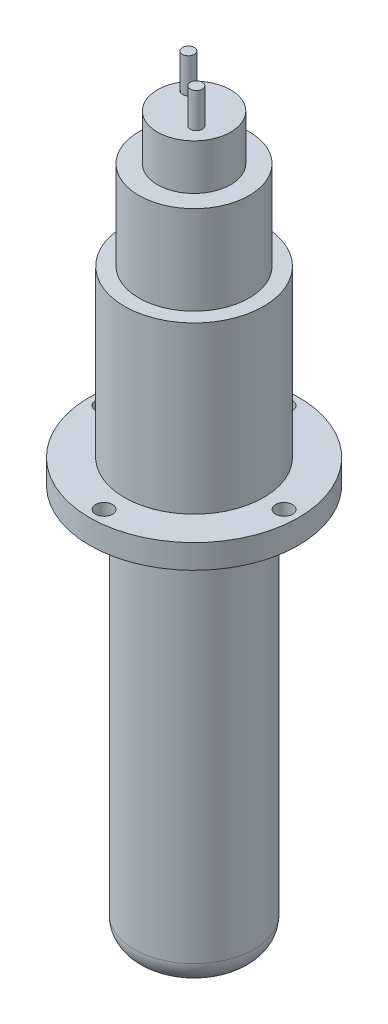
ISO-10303-21;
HEADER;
FILE_DESCRIPTION(('STEP AP214'),'2;1');
FILE_NAME('part.step','',(''),(''),'','','');
FILE_SCHEMA(('AUTOMOTIVE_DESIGN { 1 0 10303 214 1 1 1 1 }'));
ENDSEC;
DATA;
#1=APPLICATION_CONTEXT('core data for automotive mechanical design processes');
#2=APPLICATION_PROTOCOL_DEFINITION('international standard','automotive_design',2000,#1);
#3=PRODUCT_CONTEXT('',#1,'mechanical');
#4=PRODUCT('Part','Part','',(#3));
#5=PRODUCT_RELATED_PRODUCT_CATEGORY('part','',(#4));
#6=PRODUCT_DEFINITION_FORMATION('','',#4);
#7=PRODUCT_DEFINITION_CONTEXT('part definition',#1,'design');
#8=PRODUCT_DEFINITION('design','',#6,#7);
#9=PRODUCT_DEFINITION_SHAPE('','',#8);
#10=(LENGTH_UNIT() NAMED_UNIT(*) SI_UNIT(.MILLI.,.METRE.));
#11=(NAMED_UNIT(*) PLANE_ANGLE_UNIT() SI_UNIT($,.RADIAN.));
#12=(NAMED_UNIT(*) SI_UNIT($,.STERADIAN.) SOLID_ANGLE_UNIT());
#13=UNCERTAINTY_MEASURE_WITH_UNIT(LENGTH_MEASURE(1.E-05),#10,'distance_accuracy_value','');
#14=(GEOMETRIC_REPRESENTATION_CONTEXT(3) GLOBAL_UNCERTAINTY_ASSIGNED_CONTEXT((#13)) GLOBAL_UNIT_ASSIGNED_CONTEXT((#10,
#11,#12)) REPRESENTATION_CONTEXT('',''));
#15=CARTESIAN_POINT('',(0.,0.,0.));
#16=DIRECTION('',(0.,0.,1.));
#17=DIRECTION('',(1.,0.,0.));
#18=AXIS2_PLACEMENT_3D('',#15,#16,#17);
#19=CARTESIAN_POINT('',(0.,5.08,0.));
#20=DIRECTION('',(0.,-1.,0.));
#21=DIRECTION('',(0.,0.,-1.));
#22=AXIS2_PLACEMENT_3D('',#19,#20,#21);
#23=CYLINDRICAL_SURFACE('',#22,22.098);
#24=CARTESIAN_POINT('',(0.,5.08,0.));
#25=DIRECTION('',(0.,1.,0.));
#26=DIRECTION('',(0.,0.,1.));
#27=AXIS2_PLACEMENT_3D('',#24,#25,#26);
#28=CIRCLE('',#27,22.098);
#29=CARTESIAN_POINT('',(0.,5.08,22.098));
#30=VERTEX_POINT('',#29);
#31=EDGE_CURVE('E69',#30,#30,#28,.T.);
#32=ORIENTED_EDGE('',*,*,#31,.F.);
#33=EDGE_LOOP('',(#32));
#34=FACE_BOUND('',#33,.T.);
#35=CARTESIAN_POINT('',(0.,0.,0.));
#36=DIRECTION('',(0.,1.,0.));
#37=DIRECTION('',(0.,0.,1.));
#38=AXIS2_PLACEMENT_3D('',#35,#36,#37);
#39=CIRCLE('',#38,22.098);
#40=CARTESIAN_POINT('',(0.,0.,22.098));
#41=VERTEX_POINT('',#40);
#42=EDGE_CURVE('E66',#41,#41,#39,.T.);
#43=ORIENTED_EDGE('',*,*,#42,.T.);
#44=EDGE_LOOP('',(#43));
#45=FACE_BOUND('',#44,.T.);
#46=ADVANCED_FACE('F33',(#34,#45),#23,.T.);
#47=CARTESIAN_POINT('',(0.,5.08,0.));
#48=DIRECTION('',(0.,1.,0.));
#49=DIRECTION('',(0.,0.,1.));
#50=AXIS2_PLACEMENT_3D('',#47,#48,#49);
#51=PLANE('',#50);
#52=CARTESIAN_POINT('',(-19.05,5.08,0.));
#53=DIRECTION('',(0.,1.,0.));
#54=DIRECTION('',(1.,0.,0.));
#55=AXIS2_PLACEMENT_3D('',#52,#53,#54);
#56=CIRCLE('',#55,1.7907);
#57=CARTESIAN_POINT('',(-17.2593,5.08,0.));
#58=VERTEX_POINT('',#57);
#59=EDGE_CURVE('E61',#58,#58,#56,.T.);
#60=ORIENTED_EDGE('',*,*,#59,.F.);
#61=EDGE_LOOP('',(#60));
#62=FACE_BOUND('',#61,.T.);
#63=CARTESIAN_POINT('',(0.,5.08,19.05));
#64=DIRECTION('',(0.,1.,0.));
#65=DIRECTION('',(0.,0.,-1.));
#66=AXIS2_PLACEMENT_3D('',#63,#64,#65);
#67=CIRCLE('',#66,1.7907);
#68=CARTESIAN_POINT('',(0.,5.08,17.2593));
#69=VERTEX_POINT('',#68);
#70=EDGE_CURVE('E105',#69,#69,#67,.T.);
#71=ORIENTED_EDGE('',*,*,#70,.F.);
#72=EDGE_LOOP('',(#71));
#73=FACE_BOUND('',#72,.T.);
#74=CARTESIAN_POINT('',(19.05,5.08,-1.99538158514885E-13));
#75=DIRECTION('',(0.,1.,0.));
#76=DIRECTION('',(-1.,0.,0.));
#77=AXIS2_PLACEMENT_3D('',#74,#75,#76);
#78=CIRCLE('',#77,1.7907);
#79=CARTESIAN_POINT('',(17.2593,5.08,-1.80781571614486E-13));
#80=VERTEX_POINT('',#79);
#81=EDGE_CURVE('E102',#80,#80,#78,.T.);
#82=ORIENTED_EDGE('',*,*,#81,.F.);
#83=EDGE_LOOP('',(#82));
#84=FACE_BOUND('',#83,.T.);
#85=CARTESIAN_POINT('',(0.,5.08,-19.05));
#86=DIRECTION('',(0.,1.,0.));
#87=DIRECTION('',(0.,0.,1.));
#88=AXIS2_PLACEMENT_3D('',#85,#86,#87);
#89=CIRCLE('',#88,1.7907);
#90=CARTESIAN_POINT('',(0.,5.08,-17.2593));
#91=VERTEX_POINT('',#90);
#92=EDGE_CURVE('E54',#91,#91,#89,.T.);
#93=ORIENTED_EDGE('',*,*,#92,.F.);
#94=EDGE_LOOP('',(#93));
#95=FACE_BOUND('',#94,.T.);
#96=CARTESIAN_POINT('',(0.,5.08,0.));
#97=DIRECTION('',(0.,1.,0.));
#98=DIRECTION('',(0.,0.,1.));
#99=AXIS2_PLACEMENT_3D('',#96,#97,#98);
#100=CIRCLE('',#99,14.732);
#101=CARTESIAN_POINT('',(0.,5.08,14.732));
#102=VERTEX_POINT('',#101);
#103=EDGE_CURVE('E73',#102,#102,#100,.T.);
#104=ORIENTED_EDGE('',*,*,#103,.F.);
#105=EDGE_LOOP('',(#104));
#106=FACE_BOUND('',#105,.T.);
#107=ORIENTED_EDGE('',*,*,#31,.T.);
#108=EDGE_LOOP('',(#107));
#109=FACE_BOUND('',#108,.T.);
#110=ADVANCED_FACE('F114',(#62,#73,#84,#95,#106,#109),#51,.T.);
#111=CARTESIAN_POINT('',(0.,0.,0.));
#112=DIRECTION('',(0.,1.,0.));
#113=DIRECTION('',(0.,0.,1.));
#114=AXIS2_PLACEMENT_3D('',#111,#112,#113);
#115=PLANE('',#114);
#116=CARTESIAN_POINT('',(0.,0.,0.));
#117=DIRECTION('',(0.,1.,0.));
#118=DIRECTION('',(0.,0.,1.));
#119=AXIS2_PLACEMENT_3D('',#116,#117,#118);
#120=CIRCLE('',#119,12.7);
#121=CARTESIAN_POINT('',(0.,0.,12.7));
#122=VERTEX_POINT('',#121);
#123=EDGE_CURVE('E44',#122,#122,#120,.F.);
#124=ORIENTED_EDGE('',*,*,#123,.F.);
#125=EDGE_LOOP('',(#124));
#126=FACE_BOUND('',#125,.T.);
#127=CARTESIAN_POINT('',(-19.05,0.,0.));
#128=DIRECTION('',(0.,1.,0.));
#129=DIRECTION('',(0.,0.,1.));
#130=AXIS2_PLACEMENT_3D('',#127,#128,#129);
#131=CIRCLE('',#130,1.7907);
#132=CARTESIAN_POINT('',(-19.05,0.,1.79070000000007));
#133=VERTEX_POINT('',#132);
#134=EDGE_CURVE('E51',#133,#133,#131,.T.);
#135=ORIENTED_EDGE('',*,*,#134,.T.);
#136=EDGE_LOOP('',(#135));
#137=FACE_BOUND('',#136,.T.);
#138=CARTESIAN_POINT('',(0.,0.,19.05));
#139=DIRECTION('',(0.,1.,0.));
#140=DIRECTION('',(0.,0.,1.));
#141=AXIS2_PLACEMENT_3D('',#138,#139,#140);
#142=CIRCLE('',#141,1.7907);
#143=CARTESIAN_POINT('',(0.,0.,20.8407));
#144=VERTEX_POINT('',#143);
#145=EDGE_CURVE('E55',#144,#144,#142,.T.);
#146=ORIENTED_EDGE('',*,*,#145,.T.);
#147=EDGE_LOOP('',(#146));
#148=FACE_BOUND('',#147,.T.);
#149=CARTESIAN_POINT('',(19.05,0.,-1.99538158514885E-13));
#150=DIRECTION('',(0.,1.,0.));
#151=DIRECTION('',(0.,0.,1.));
#152=AXIS2_PLACEMENT_3D('',#149,#150,#151);
#153=CIRCLE('',#152,1.7907);
#154=CARTESIAN_POINT('',(19.05,0.,1.7906999999998));
#155=VERTEX_POINT('',#154);
#156=EDGE_CURVE('E58',#155,#155,#153,.T.);
#157=ORIENTED_EDGE('',*,*,#156,.T.);
#158=EDGE_LOOP('',(#157));
#159=FACE_BOUND('',#158,.T.);
#160=CARTESIAN_POINT('',(0.,0.,-19.05));
#161=DIRECTION('',(0.,1.,0.));
#162=DIRECTION('',(0.,0.,1.));
#163=AXIS2_PLACEMENT_3D('',#160,#161,#162);
#164=CIRCLE('',#163,1.7907);
#165=CARTESIAN_POINT('',(0.,0.,-17.2593));
#166=VERTEX_POINT('',#165);
#167=EDGE_CURVE('E62',#166,#166,#164,.T.);
#168=ORIENTED_EDGE('',*,*,#167,.T.);
#169=EDGE_LOOP('',(#168));
#170=FACE_BOUND('',#169,.T.);
#171=ORIENTED_EDGE('',*,*,#42,.F.);
#172=EDGE_LOOP('',(#171));
#173=FACE_BOUND('',#172,.T.);
#174=ADVANCED_FACE('F117',(#126,#137,#148,#159,#170,#173),#115,.F.);
#175=CARTESIAN_POINT('',(0.,40.132,0.));
#176=DIRECTION('',(0.,-1.,0.));
#177=DIRECTION('',(0.,0.,-1.));
#178=AXIS2_PLACEMENT_3D('',#175,#176,#177);
#179=CYLINDRICAL_SURFACE('',#178,14.732);
#180=CARTESIAN_POINT('',(0.,40.132,0.));
#181=DIRECTION('',(0.,1.,0.));
#182=DIRECTION('',(0.,0.,1.));
#183=AXIS2_PLACEMENT_3D('',#180,#181,#182);
#184=CIRCLE('',#183,14.732);
#185=CARTESIAN_POINT('',(0.,40.132,14.732));
#186=VERTEX_POINT('',#185);
#187=EDGE_CURVE('E70',#186,#186,#184,.T.);
#188=ORIENTED_EDGE('',*,*,#187,.F.);
#189=EDGE_LOOP('',(#188));
#190=FACE_BOUND('',#189,.T.);
#191=ORIENTED_EDGE('',*,*,#103,.T.);
#192=EDGE_LOOP('',(#191));
#193=FACE_BOUND('',#192,.T.);
#194=ADVANCED_FACE('F134',(#190,#193),#179,.T.);
#195=CARTESIAN_POINT('',(0.,40.132,0.));
#196=DIRECTION('',(0.,1.,0.));
#197=DIRECTION('',(0.,0.,1.));
#198=AXIS2_PLACEMENT_3D('',#195,#196,#197);
#199=PLANE('',#198);
#200=CARTESIAN_POINT('',(0.,40.132,0.));
#201=DIRECTION('',(0.,1.,0.));
#202=DIRECTION('',(0.,0.,1.));
#203=AXIS2_PLACEMENT_3D('',#200,#201,#202);
#204=CIRCLE('',#203,11.684);
#205=CARTESIAN_POINT('',(0.,40.132,11.684));
#206=VERTEX_POINT('',#205);
#207=EDGE_CURVE('E76',#206,#206,#204,.T.);
#208=ORIENTED_EDGE('',*,*,#207,.F.);
#209=EDGE_LOOP('',(#208));
#210=FACE_BOUND('',#209,.T.);
#211=ORIENTED_EDGE('',*,*,#187,.T.);
#212=EDGE_LOOP('',(#211));
#213=FACE_BOUND('',#212,.T.);
#214=ADVANCED_FACE('F140',(#210,#213),#199,.T.);
#215=CARTESIAN_POINT('',(0.,58.928,0.));
#216=DIRECTION('',(0.,-1.,0.));
#217=DIRECTION('',(0.,0.,-1.));
#218=AXIS2_PLACEMENT_3D('',#215,#216,#217);
#219=CYLINDRICAL_SURFACE('',#218,11.684);
#220=CARTESIAN_POINT('',(0.,58.928,0.));
#221=DIRECTION('',(0.,1.,0.));
#222=DIRECTION('',(0.,0.,1.));
#223=AXIS2_PLACEMENT_3D('',#220,#221,#222);
#224=CIRCLE('',#223,11.684);
#225=CARTESIAN_POINT('',(0.,58.928,11.684));
#226=VERTEX_POINT('',#225);
#227=EDGE_CURVE('E79',#226,#226,#224,.T.);
#228=ORIENTED_EDGE('',*,*,#227,.F.);
#229=EDGE_LOOP('',(#228));
#230=FACE_BOUND('',#229,.T.);
#231=ORIENTED_EDGE('',*,*,#207,.T.);
#232=EDGE_LOOP('',(#231));
#233=FACE_BOUND('',#232,.T.);
#234=ADVANCED_FACE('F148',(#230,#233),#219,.T.);
#235=CARTESIAN_POINT('',(0.,58.928,0.));
#236=DIRECTION('',(0.,1.,0.));
#237=DIRECTION('',(0.,0.,1.));
#238=AXIS2_PLACEMENT_3D('',#235,#236,#237);
#239=PLANE('',#238);
#240=CARTESIAN_POINT('',(0.,58.928,0.));
#241=DIRECTION('',(0.,1.,0.));
#242=DIRECTION('',(0.,0.,1.));
#243=AXIS2_PLACEMENT_3D('',#240,#241,#242);
#244=CIRCLE('',#243,7.747);
#245=CARTESIAN_POINT('',(0.,58.928,7.747));
#246=VERTEX_POINT('',#245);
#247=EDGE_CURVE('E48',#246,#246,#244,.T.);
#248=ORIENTED_EDGE('',*,*,#247,.F.);
#249=EDGE_LOOP('',(#248));
#250=FACE_BOUND('',#249,.T.);
#251=ORIENTED_EDGE('',*,*,#227,.T.);
#252=EDGE_LOOP('',(#251));
#253=FACE_BOUND('',#252,.T.);
#254=ADVANCED_FACE('F152',(#250,#253),#239,.T.);
#255=CARTESIAN_POINT('',(0.,68.58,0.));
#256=DIRECTION('',(0.,-1.,0.));
#257=DIRECTION('',(0.,0.,-1.));
#258=AXIS2_PLACEMENT_3D('',#255,#256,#257);
#259=CYLINDRICAL_SURFACE('',#258,7.747);
#260=CARTESIAN_POINT('',(0.,68.58,0.));
#261=DIRECTION('',(0.,1.,0.));
#262=DIRECTION('',(0.,0.,1.));
#263=AXIS2_PLACEMENT_3D('',#260,#261,#262);
#264=CIRCLE('',#263,7.747);
#265=CARTESIAN_POINT('',(0.,68.58,7.747));
#266=VERTEX_POINT('',#265);
#267=EDGE_CURVE('E84',#266,#266,#264,.T.);
#268=ORIENTED_EDGE('',*,*,#267,.F.);
#269=EDGE_LOOP('',(#268));
#270=FACE_BOUND('',#269,.T.);
#271=ORIENTED_EDGE('',*,*,#247,.T.);
#272=EDGE_LOOP('',(#271));
#273=FACE_BOUND('',#272,.T.);
#274=ADVANCED_FACE('F156',(#270,#273),#259,.T.);
#275=CARTESIAN_POINT('',(0.,68.58,0.));
#276=DIRECTION('',(0.,1.,0.));
#277=DIRECTION('',(0.,0.,1.));
#278=AXIS2_PLACEMENT_3D('',#275,#276,#277);
#279=PLANE('',#278);
#280=CARTESIAN_POINT('',(2.97002677292824,68.58,2.48175750236612));
#281=DIRECTION('',(0.,1.,0.));
#282=DIRECTION('',(0.,0.,1.));
#283=AXIS2_PLACEMENT_3D('',#280,#281,#282);
#284=CIRCLE('',#283,1.27);
#285=CARTESIAN_POINT('',(2.97002677292824,68.58,3.75175750236612));
#286=VERTEX_POINT('',#285);
#287=EDGE_CURVE('E65',#286,#286,#284,.T.);
#288=ORIENTED_EDGE('',*,*,#287,.F.);
#289=EDGE_LOOP('',(#288));
#290=FACE_BOUND('',#289,.T.);
#291=CARTESIAN_POINT('',(-4.24340631789732,68.58,-3.04439882199858));
#292=DIRECTION('',(0.,1.,0.));
#293=DIRECTION('',(0.,0.,1.));
#294=AXIS2_PLACEMENT_3D('',#291,#292,#293);
#295=CIRCLE('',#294,1.27);
#296=CARTESIAN_POINT('',(-4.24340631789732,68.58,-1.77439882199858));
#297=VERTEX_POINT('',#296);
#298=EDGE_CURVE('E90',#297,#297,#295,.T.);
#299=ORIENTED_EDGE('',*,*,#298,.F.);
#300=EDGE_LOOP('',(#299));
#301=FACE_BOUND('',#300,.T.);
#302=ORIENTED_EDGE('',*,*,#267,.T.);
#303=EDGE_LOOP('',(#302));
#304=FACE_BOUND('',#303,.T.);
#305=ADVANCED_FACE('F160',(#290,#301,#304),#279,.T.);
#306=CARTESIAN_POINT('',(-4.24340631789732,75.946,-3.04439882199858));
#307=DIRECTION('',(0.,-1.,0.));
#308=DIRECTION('',(0.,0.,-1.));
#309=AXIS2_PLACEMENT_3D('',#306,#307,#308);
#310=CYLINDRICAL_SURFACE('',#309,1.27);
#311=CARTESIAN_POINT('',(-4.24340631789732,75.946,-3.04439882199858));
#312=DIRECTION('',(0.,1.,0.));
#313=DIRECTION('',(0.,0.,1.));
#314=AXIS2_PLACEMENT_3D('',#311,#312,#313);
#315=CIRCLE('',#314,1.27);
#316=CARTESIAN_POINT('',(-4.24340631789732,75.946,-1.77439882199858));
#317=VERTEX_POINT('',#316);
#318=EDGE_CURVE('E89',#317,#317,#315,.T.);
#319=ORIENTED_EDGE('',*,*,#318,.F.);
#320=EDGE_LOOP('',(#319));
#321=FACE_BOUND('',#320,.T.);
#322=ORIENTED_EDGE('',*,*,#298,.T.);
#323=EDGE_LOOP('',(#322));
#324=FACE_BOUND('',#323,.T.);
#325=ADVANCED_FACE('F164',(#321,#324),#310,.T.);
#326=CARTESIAN_POINT('',(-4.24340631789732,75.946,-3.04439882199858));
#327=DIRECTION('',(0.,1.,0.));
#328=DIRECTION('',(0.,0.,1.));
#329=AXIS2_PLACEMENT_3D('',#326,#327,#328);
#330=PLANE('',#329);
#331=ORIENTED_EDGE('',*,*,#318,.T.);
#332=EDGE_LOOP('',(#331));
#333=FACE_BOUND('',#332,.T.);
#334=ADVANCED_FACE('F168',(#333),#330,.T.);
#335=CARTESIAN_POINT('',(2.97002677292824,75.946,2.48175750236612));
#336=DIRECTION('',(0.,-1.,0.));
#337=DIRECTION('',(0.,0.,-1.));
#338=AXIS2_PLACEMENT_3D('',#335,#336,#337);
#339=CYLINDRICAL_SURFACE('',#338,1.27);
#340=CARTESIAN_POINT('',(2.97002677292824,75.946,2.48175750236612));
#341=DIRECTION('',(0.,1.,0.));
#342=DIRECTION('',(0.,0.,1.));
#343=AXIS2_PLACEMENT_3D('',#340,#341,#342);
#344=CIRCLE('',#343,1.27);
#345=CARTESIAN_POINT('',(2.97002677292824,75.946,3.75175750236612));
#346=VERTEX_POINT('',#345);
#347=EDGE_CURVE('E93',#346,#346,#344,.T.);
#348=ORIENTED_EDGE('',*,*,#347,.F.);
#349=EDGE_LOOP('',(#348));
#350=FACE_BOUND('',#349,.T.);
#351=ORIENTED_EDGE('',*,*,#287,.T.);
#352=EDGE_LOOP('',(#351));
#353=FACE_BOUND('',#352,.T.);
#354=ADVANCED_FACE('F172',(#350,#353),#339,.T.);
#355=CARTESIAN_POINT('',(2.97002677292824,75.946,2.48175750236612));
#356=DIRECTION('',(0.,1.,0.));
#357=DIRECTION('',(0.,0.,1.));
#358=AXIS2_PLACEMENT_3D('',#355,#356,#357);
#359=PLANE('',#358);
#360=ORIENTED_EDGE('',*,*,#347,.T.);
#361=EDGE_LOOP('',(#360));
#362=FACE_BOUND('',#361,.T.);
#363=ADVANCED_FACE('F176',(#362),#359,.T.);
#364=CARTESIAN_POINT('',(0.,-2.286,-19.05));
#365=DIRECTION('',(0.,1.,0.));
#366=DIRECTION('',(0.,0.,1.));
#367=AXIS2_PLACEMENT_3D('',#364,#365,#366);
#368=CYLINDRICAL_SURFACE('',#367,1.7907);
#369=ORIENTED_EDGE('',*,*,#92,.T.);
#370=EDGE_LOOP('',(#369));
#371=FACE_BOUND('',#370,.T.);
#372=ORIENTED_EDGE('',*,*,#167,.F.);
#373=EDGE_LOOP('',(#372));
#374=FACE_BOUND('',#373,.T.);
#375=ADVANCED_FACE('F180',(#371,#374),#368,.F.);
#376=CARTESIAN_POINT('',(19.05,-2.286,-1.99538158514885E-13));
#377=DIRECTION('',(0.,1.,0.));
#378=DIRECTION('',(0.,0.,1.));
#379=AXIS2_PLACEMENT_3D('',#376,#377,#378);
#380=CYLINDRICAL_SURFACE('',#379,1.7907);
#381=ORIENTED_EDGE('',*,*,#81,.T.);
#382=EDGE_LOOP('',(#381));
#383=FACE_BOUND('',#382,.T.);
#384=ORIENTED_EDGE('',*,*,#156,.F.);
#385=EDGE_LOOP('',(#384));
#386=FACE_BOUND('',#385,.T.);
#387=ADVANCED_FACE('F184',(#383,#386),#380,.F.);
#388=CARTESIAN_POINT('',(0.,-2.286,19.05));
#389=DIRECTION('',(0.,1.,0.));
#390=DIRECTION('',(0.,0.,1.));
#391=AXIS2_PLACEMENT_3D('',#388,#389,#390);
#392=CYLINDRICAL_SURFACE('',#391,1.7907);
#393=ORIENTED_EDGE('',*,*,#70,.T.);
#394=EDGE_LOOP('',(#393));
#395=FACE_BOUND('',#394,.T.);
#396=ORIENTED_EDGE('',*,*,#145,.F.);
#397=EDGE_LOOP('',(#396));
#398=FACE_BOUND('',#397,.T.);
#399=ADVANCED_FACE('F188',(#395,#398),#392,.F.);
#400=CARTESIAN_POINT('',(-19.05,-2.286,0.));
#401=DIRECTION('',(0.,1.,0.));
#402=DIRECTION('',(0.,0.,1.));
#403=AXIS2_PLACEMENT_3D('',#400,#401,#402);
#404=CYLINDRICAL_SURFACE('',#403,1.7907);
#405=ORIENTED_EDGE('',*,*,#59,.T.);
#406=EDGE_LOOP('',(#405));
#407=FACE_BOUND('',#406,.T.);
#408=ORIENTED_EDGE('',*,*,#134,.F.);
#409=EDGE_LOOP('',(#408));
#410=FACE_BOUND('',#409,.T.);
#411=ADVANCED_FACE('F111',(#407,#410),#404,.F.);
#412=CARTESIAN_POINT('',(0.,-83.82,0.));
#413=DIRECTION('',(0.,1.,0.));
#414=DIRECTION('',(0.,0.,1.));
#415=AXIS2_PLACEMENT_3D('',#412,#413,#414);
#416=CYLINDRICAL_SURFACE('',#415,12.7);
#417=CARTESIAN_POINT('',(0.,-78.74,0.));
#418=DIRECTION('',(0.,-1.,0.));
#419=DIRECTION('',(0.,0.,-1.));
#420=AXIS2_PLACEMENT_3D('',#417,#418,#419);
#421=CIRCLE('',#420,12.7);
#422=CARTESIAN_POINT('',(0.,-78.74,-12.7));
#423=VERTEX_POINT('',#422);
#424=EDGE_CURVE('E10',#423,#423,#421,.F.);
#425=ORIENTED_EDGE('',*,*,#424,.T.);
#426=EDGE_LOOP('',(#425));
#427=FACE_BOUND('',#426,.T.);
#428=ORIENTED_EDGE('',*,*,#123,.T.);
#429=EDGE_LOOP('',(#428));
#430=FACE_BOUND('',#429,.T.);
#431=ADVANCED_FACE('F195',(#427,#430),#416,.T.);
#432=CARTESIAN_POINT('',(0.,-83.82,0.));
#433=DIRECTION('',(0.,-1.,0.));
#434=DIRECTION('',(0.,0.,-1.));
#435=AXIS2_PLACEMENT_3D('',#432,#433,#434);
#436=PLANE('',#435);
#437=CARTESIAN_POINT('',(0.,-83.82,0.));
#438=DIRECTION('',(0.,-1.,0.));
#439=DIRECTION('',(0.,0.,-1.));
#440=AXIS2_PLACEMENT_3D('',#437,#438,#439);
#441=CIRCLE('',#440,7.62);
#442=CARTESIAN_POINT('',(0.,-83.82,-7.62));
#443=VERTEX_POINT('',#442);
#444=EDGE_CURVE('E40',#443,#443,#441,.T.);
#445=ORIENTED_EDGE('',*,*,#444,.T.);
#446=EDGE_LOOP('',(#445));
#447=FACE_BOUND('',#446,.T.);
#448=ADVANCED_FACE('F198',(#447),#436,.T.);
#449=CARTESIAN_POINT('',(0.,-78.74,0.));
#450=DIRECTION('',(0.,-1.,0.));
#451=DIRECTION('',(0.,0.,-1.));
#452=AXIS2_PLACEMENT_3D('',#449,#450,#451);
#453=TOROIDAL_SURFACE('',#452,7.62,5.08);
#454=ORIENTED_EDGE('',*,*,#424,.F.);
#455=EDGE_LOOP('',(#454));
#456=FACE_BOUND('',#455,.T.);
#457=ORIENTED_EDGE('',*,*,#444,.F.);
#458=EDGE_LOOP('',(#457));
#459=FACE_BOUND('',#458,.T.);
#460=ADVANCED_FACE('F35',(#456,#459),#453,.T.);
#461=CLOSED_SHELL('',(#46,#110,#174,#194,#214,#234,#254,#274,#305,#325,#334,#354,#363,#375,#387,
#399,#411,#431,#448,#460));
#462=MANIFOLD_SOLID_BREP('B2',#461);
#463=ADVANCED_BREP_SHAPE_REPRESENTATION('',(#18,#462),#14);
#464=SHAPE_DEFINITION_REPRESENTATION(#9,#463);
ENDSEC;
END-ISO-10303-21;
